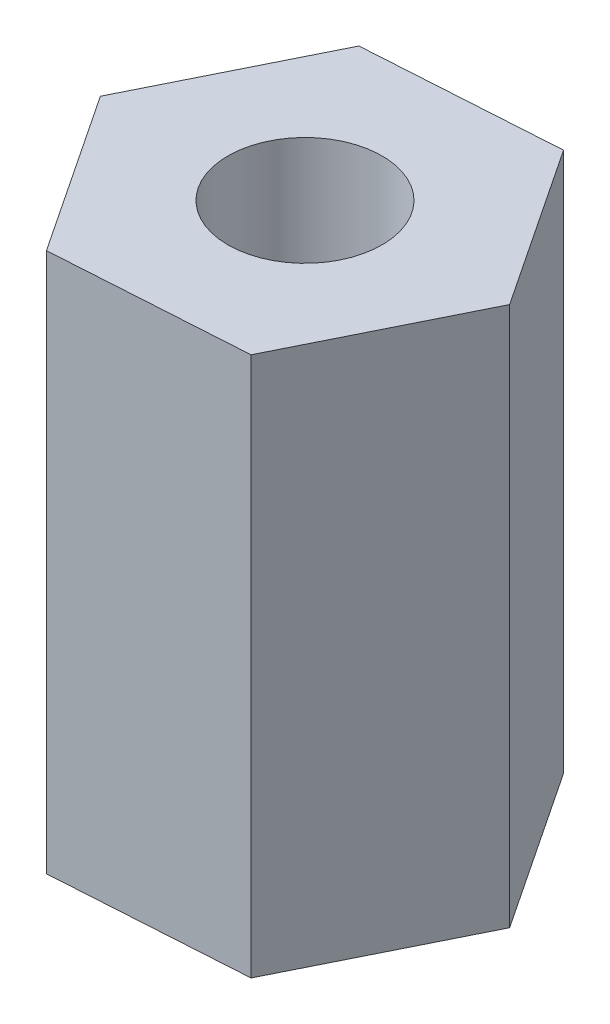
ISO-10303-21;
HEADER;
FILE_DESCRIPTION(('STEP AP214'),'2;1');
FILE_NAME('part.step','',(''),(''),'','','');
FILE_SCHEMA(('AUTOMOTIVE_DESIGN { 1 0 10303 214 1 1 1 1 }'));
ENDSEC;
DATA;
#1=APPLICATION_CONTEXT('core data for automotive mechanical design processes');
#2=APPLICATION_PROTOCOL_DEFINITION('international standard','automotive_design',2000,#1);
#3=PRODUCT_CONTEXT('',#1,'mechanical');
#4=PRODUCT('Part','Part','',(#3));
#5=PRODUCT_RELATED_PRODUCT_CATEGORY('part','',(#4));
#6=PRODUCT_DEFINITION_FORMATION('','',#4);
#7=PRODUCT_DEFINITION_CONTEXT('part definition',#1,'design');
#8=PRODUCT_DEFINITION('design','',#6,#7);
#9=PRODUCT_DEFINITION_SHAPE('','',#8);
#10=(LENGTH_UNIT() NAMED_UNIT(*) SI_UNIT(.MILLI.,.METRE.));
#11=(NAMED_UNIT(*) PLANE_ANGLE_UNIT() SI_UNIT($,.RADIAN.));
#12=(NAMED_UNIT(*) SI_UNIT($,.STERADIAN.) SOLID_ANGLE_UNIT());
#13=UNCERTAINTY_MEASURE_WITH_UNIT(LENGTH_MEASURE(1.E-05),#10,'distance_accuracy_value','');
#14=(GEOMETRIC_REPRESENTATION_CONTEXT(3) GLOBAL_UNCERTAINTY_ASSIGNED_CONTEXT((#13)) GLOBAL_UNIT_ASSIGNED_CONTEXT((#10,
#11,#12)) REPRESENTATION_CONTEXT('',''));
#15=CARTESIAN_POINT('',(0.,0.,0.));
#16=DIRECTION('',(0.,0.,1.));
#17=DIRECTION('',(1.,0.,0.));
#18=AXIS2_PLACEMENT_3D('',#15,#16,#17);
#19=CARTESIAN_POINT('',(-7.49074246217419,21.,0.471286217402918));
#20=DIRECTION('',(0.832920604348991,0.,-0.553392507042617));
#21=DIRECTION('',(-0.553392507042617,0.,-0.832920604348991));
#22=AXIS2_PLACEMENT_3D('',#19,#20,#21);
#23=PLANE('',#22);
#24=DIRECTION('',(0.553392507042617,0.,0.83292060434899));
#25=VECTOR('',#24,1.);
#26=CARTESIAN_POINT('',(-7.49074246217419,0.,0.471286217402918));
#27=LINE('',#26,#25);
#28=CARTESIAN_POINT('',(-7.49074246217419,0.,0.471286217402918));
#29=VERTEX_POINT('',#28);
#30=CARTESIAN_POINT('',(-3.33722539436269,0.,6.7228163741511));
#31=VERTEX_POINT('',#30);
#32=EDGE_CURVE('E144',#29,#31,#27,.T.);
#33=ORIENTED_EDGE('',*,*,#32,.T.);
#34=DIRECTION('',(0.,-1.,0.));
#35=VECTOR('',#34,1.);
#36=CARTESIAN_POINT('',(-3.33722539436269,21.,6.7228163741511));
#37=LINE('',#36,#35);
#38=CARTESIAN_POINT('',(-3.33722539436269,21.,6.7228163741511));
#39=VERTEX_POINT('',#38);
#40=EDGE_CURVE('E13',#39,#31,#37,.T.);
#41=ORIENTED_EDGE('',*,*,#40,.F.);
#42=DIRECTION('',(0.553392507042617,0.,0.83292060434899));
#43=VECTOR('',#42,1.);
#44=CARTESIAN_POINT('',(-7.49074246217419,21.,0.471286217402918));
#45=LINE('',#44,#43);
#46=CARTESIAN_POINT('',(-7.49074246217419,21.,0.471286217402918));
#47=VERTEX_POINT('',#46);
#48=EDGE_CURVE('E161',#47,#39,#45,.T.);
#49=ORIENTED_EDGE('',*,*,#48,.F.);
#50=DIRECTION('',(0.,-1.,0.));
#51=VECTOR('',#50,1.);
#52=CARTESIAN_POINT('',(-7.49074246217419,21.,0.471286217402918));
#53=LINE('',#52,#51);
#54=EDGE_CURVE('E140',#47,#29,#53,.T.);
#55=ORIENTED_EDGE('',*,*,#54,.T.);
#56=EDGE_LOOP('',(#33,#41,#49,#55));
#57=FACE_BOUND('',#56,.T.);
#58=ADVANCED_FACE('F52',(#57),#23,.F.);
#59=CARTESIAN_POINT('',(-3.33722539436269,21.,6.7228163741511));
#60=DIRECTION('',(-0.0627916671883695,0.,-0.998026656223021));
#61=DIRECTION('',(-0.998026656223022,0.,0.0627916671883695));
#62=AXIS2_PLACEMENT_3D('',#59,#60,#61);
#63=PLANE('',#62);
#64=DIRECTION('',(0.998026656223022,0.,-0.0627916671883695));
#65=VECTOR('',#64,1.);
#66=CARTESIAN_POINT('',(-3.33722539436269,0.,6.7228163741511));
#67=LINE('',#66,#65);
#68=CARTESIAN_POINT('',(4.15351706781149,0.,6.25153015674818));
#69=VERTEX_POINT('',#68);
#70=EDGE_CURVE('E148',#31,#69,#67,.T.);
#71=ORIENTED_EDGE('',*,*,#70,.T.);
#72=DIRECTION('',(0.,-1.,0.));
#73=VECTOR('',#72,1.);
#74=CARTESIAN_POINT('',(4.15351706781149,21.,6.25153015674818));
#75=LINE('',#74,#73);
#76=CARTESIAN_POINT('',(4.15351706781149,21.,6.25153015674818));
#77=VERTEX_POINT('',#76);
#78=EDGE_CURVE('E61',#77,#69,#75,.T.);
#79=ORIENTED_EDGE('',*,*,#78,.F.);
#80=DIRECTION('',(0.998026656223022,0.,-0.0627916671883695));
#81=VECTOR('',#80,1.);
#82=CARTESIAN_POINT('',(-3.33722539436269,21.,6.7228163741511));
#83=LINE('',#82,#81);
#84=EDGE_CURVE('E106',#39,#77,#83,.T.);
#85=ORIENTED_EDGE('',*,*,#84,.F.);
#86=ORIENTED_EDGE('',*,*,#40,.T.);
#87=EDGE_LOOP('',(#71,#79,#85,#86));
#88=FACE_BOUND('',#87,.T.);
#89=ADVANCED_FACE('F189',(#88),#63,.F.);
#90=CARTESIAN_POINT('',(4.15351706781149,21.,6.25153015674818));
#91=DIRECTION('',(-0.89571227153736,0.,-0.444634149180405));
#92=DIRECTION('',(-0.444634149180405,0.,0.89571227153736));
#93=AXIS2_PLACEMENT_3D('',#90,#91,#92);
#94=PLANE('',#93);
#95=DIRECTION('',(0.444634149180405,0.,-0.89571227153736));
#96=VECTOR('',#95,1.);
#97=CARTESIAN_POINT('',(4.15351706781149,0.,6.25153015674818));
#98=LINE('',#97,#96);
#99=CARTESIAN_POINT('',(7.49074246217418,0.,-0.471286217402919));
#100=VERTEX_POINT('',#99);
#101=EDGE_CURVE('E152',#69,#100,#98,.T.);
#102=ORIENTED_EDGE('',*,*,#101,.T.);
#103=DIRECTION('',(0.,-1.,0.));
#104=VECTOR('',#103,1.);
#105=CARTESIAN_POINT('',(7.49074246217418,21.,-0.471286217402919));
#106=LINE('',#105,#104);
#107=CARTESIAN_POINT('',(7.49074246217418,21.,-0.471286217402919));
#108=VERTEX_POINT('',#107);
#109=EDGE_CURVE('E130',#108,#100,#106,.T.);
#110=ORIENTED_EDGE('',*,*,#109,.F.);
#111=DIRECTION('',(0.444634149180405,0.,-0.89571227153736));
#112=VECTOR('',#111,1.);
#113=CARTESIAN_POINT('',(4.15351706781149,21.,6.25153015674818));
#114=LINE('',#113,#112);
#115=EDGE_CURVE('E119',#77,#108,#114,.T.);
#116=ORIENTED_EDGE('',*,*,#115,.F.);
#117=ORIENTED_EDGE('',*,*,#78,.T.);
#118=EDGE_LOOP('',(#102,#110,#116,#117));
#119=FACE_BOUND('',#118,.T.);
#120=ADVANCED_FACE('F170',(#119),#94,.F.);
#121=CARTESIAN_POINT('',(7.49074246217418,21.,-0.471286217402919));
#122=DIRECTION('',(-0.83292060434899,0.,0.553392507042617));
#123=DIRECTION('',(0.553392507042617,0.,0.832920604348991));
#124=AXIS2_PLACEMENT_3D('',#121,#122,#123);
#125=PLANE('',#124);
#126=DIRECTION('',(-0.553392507042617,0.,-0.832920604348991));
#127=VECTOR('',#126,1.);
#128=CARTESIAN_POINT('',(7.49074246217418,0.,-0.471286217402919));
#129=LINE('',#128,#127);
#130=CARTESIAN_POINT('',(3.33722539436269,0.,-6.7228163741511));
#131=VERTEX_POINT('',#130);
#132=EDGE_CURVE('E128',#100,#131,#129,.T.);
#133=ORIENTED_EDGE('',*,*,#132,.T.);
#134=DIRECTION('',(0.,-1.,0.));
#135=VECTOR('',#134,1.);
#136=CARTESIAN_POINT('',(3.33722539436269,21.,-6.7228163741511));
#137=LINE('',#136,#135);
#138=CARTESIAN_POINT('',(3.33722539436269,21.,-6.7228163741511));
#139=VERTEX_POINT('',#138);
#140=EDGE_CURVE('E125',#139,#131,#137,.T.);
#141=ORIENTED_EDGE('',*,*,#140,.F.);
#142=DIRECTION('',(-0.553392507042617,0.,-0.832920604348991));
#143=VECTOR('',#142,1.);
#144=CARTESIAN_POINT('',(7.49074246217418,21.,-0.471286217402919));
#145=LINE('',#144,#143);
#146=EDGE_CURVE('E113',#108,#139,#145,.T.);
#147=ORIENTED_EDGE('',*,*,#146,.F.);
#148=ORIENTED_EDGE('',*,*,#109,.T.);
#149=EDGE_LOOP('',(#133,#141,#147,#148));
#150=FACE_BOUND('',#149,.T.);
#151=ADVANCED_FACE('F126',(#150),#125,.F.);
#152=CARTESIAN_POINT('',(3.33722539436269,21.,-6.7228163741511));
#153=DIRECTION('',(0.0627916671883696,0.,0.998026656223021));
#154=DIRECTION('',(0.998026656223022,0.,-0.0627916671883696));
#155=AXIS2_PLACEMENT_3D('',#152,#153,#154);
#156=PLANE('',#155);
#157=DIRECTION('',(-0.998026656223022,0.,0.0627916671883696));
#158=VECTOR('',#157,1.);
#159=CARTESIAN_POINT('',(3.33722539436269,0.,-6.7228163741511));
#160=LINE('',#159,#158);
#161=CARTESIAN_POINT('',(-4.1535170678115,0.,-6.25153015674818));
#162=VERTEX_POINT('',#161);
#163=EDGE_CURVE('E92',#131,#162,#160,.T.);
#164=ORIENTED_EDGE('',*,*,#163,.T.);
#165=DIRECTION('',(0.,-1.,0.));
#166=VECTOR('',#165,1.);
#167=CARTESIAN_POINT('',(-4.1535170678115,21.,-6.25153015674818));
#168=LINE('',#167,#166);
#169=CARTESIAN_POINT('',(-4.1535170678115,21.,-6.25153015674818));
#170=VERTEX_POINT('',#169);
#171=EDGE_CURVE('E131',#170,#162,#168,.T.);
#172=ORIENTED_EDGE('',*,*,#171,.F.);
#173=DIRECTION('',(-0.998026656223022,0.,0.0627916671883696));
#174=VECTOR('',#173,1.);
#175=CARTESIAN_POINT('',(3.33722539436269,21.,-6.7228163741511));
#176=LINE('',#175,#174);
#177=EDGE_CURVE('E117',#139,#170,#176,.T.);
#178=ORIENTED_EDGE('',*,*,#177,.F.);
#179=ORIENTED_EDGE('',*,*,#140,.T.);
#180=EDGE_LOOP('',(#164,#172,#178,#179));
#181=FACE_BOUND('',#180,.T.);
#182=ADVANCED_FACE('F133',(#181),#156,.F.);
#183=CARTESIAN_POINT('',(-4.1535170678115,21.,-6.25153015674818));
#184=DIRECTION('',(0.89571227153736,0.,0.444634149180405));
#185=DIRECTION('',(0.444634149180405,0.,-0.89571227153736));
#186=AXIS2_PLACEMENT_3D('',#183,#184,#185);
#187=PLANE('',#186);
#188=DIRECTION('',(-0.444634149180405,0.,0.89571227153736));
#189=VECTOR('',#188,1.);
#190=CARTESIAN_POINT('',(-4.1535170678115,0.,-6.25153015674818));
#191=LINE('',#190,#189);
#192=EDGE_CURVE('E98',#162,#29,#191,.T.);
#193=ORIENTED_EDGE('',*,*,#192,.T.);
#194=ORIENTED_EDGE('',*,*,#54,.F.);
#195=DIRECTION('',(-0.444634149180405,0.,0.89571227153736));
#196=VECTOR('',#195,1.);
#197=CARTESIAN_POINT('',(-4.1535170678115,21.,-6.25153015674818));
#198=LINE('',#197,#196);
#199=EDGE_CURVE('E69',#170,#47,#198,.T.);
#200=ORIENTED_EDGE('',*,*,#199,.F.);
#201=ORIENTED_EDGE('',*,*,#171,.T.);
#202=EDGE_LOOP('',(#193,#194,#200,#201));
#203=FACE_BOUND('',#202,.T.);
#204=ADVANCED_FACE('F177',(#203),#187,.F.);
#205=CARTESIAN_POINT('',(0.,21.,0.));
#206=DIRECTION('',(0.,1.,0.));
#207=DIRECTION('',(0.,0.,1.));
#208=AXIS2_PLACEMENT_3D('',#205,#206,#207);
#209=PLANE('',#208);
#210=CARTESIAN_POINT('',(0.,21.,0.));
#211=DIRECTION('',(0.,1.,0.));
#212=DIRECTION('',(0.,0.,1.));
#213=AXIS2_PLACEMENT_3D('',#210,#211,#212);
#214=CIRCLE('',#213,3.);
#215=CARTESIAN_POINT('',(0.,21.,3.));
#216=VERTEX_POINT('',#215);
#217=EDGE_CURVE('E238',#216,#216,#214,.T.);
#218=ORIENTED_EDGE('',*,*,#217,.F.);
#219=EDGE_LOOP('',(#218));
#220=FACE_BOUND('',#219,.T.);
#221=ORIENTED_EDGE('',*,*,#48,.T.);
#222=ORIENTED_EDGE('',*,*,#84,.T.);
#223=ORIENTED_EDGE('',*,*,#115,.T.);
#224=ORIENTED_EDGE('',*,*,#146,.T.);
#225=ORIENTED_EDGE('',*,*,#177,.T.);
#226=ORIENTED_EDGE('',*,*,#199,.T.);
#227=EDGE_LOOP('',(#221,#222,#223,#224,#225,#226));
#228=FACE_BOUND('',#227,.T.);
#229=ADVANCED_FACE('F115',(#220,#228),#209,.T.);
#230=CARTESIAN_POINT('',(0.,0.,0.));
#231=DIRECTION('',(0.,1.,0.));
#232=DIRECTION('',(0.,0.,1.));
#233=AXIS2_PLACEMENT_3D('',#230,#231,#232);
#234=PLANE('',#233);
#235=CARTESIAN_POINT('',(0.,0.,0.));
#236=DIRECTION('',(0.,1.,0.));
#237=DIRECTION('',(0.,0.,1.));
#238=AXIS2_PLACEMENT_3D('',#235,#236,#237);
#239=CIRCLE('',#238,3.);
#240=CARTESIAN_POINT('',(0.,0.,3.));
#241=VERTEX_POINT('',#240);
#242=EDGE_CURVE('E149',#241,#241,#239,.T.);
#243=ORIENTED_EDGE('',*,*,#242,.T.);
#244=EDGE_LOOP('',(#243));
#245=FACE_BOUND('',#244,.T.);
#246=ORIENTED_EDGE('',*,*,#32,.F.);
#247=ORIENTED_EDGE('',*,*,#192,.F.);
#248=ORIENTED_EDGE('',*,*,#163,.F.);
#249=ORIENTED_EDGE('',*,*,#132,.F.);
#250=ORIENTED_EDGE('',*,*,#101,.F.);
#251=ORIENTED_EDGE('',*,*,#70,.F.);
#252=EDGE_LOOP('',(#246,#247,#248,#249,#250,#251));
#253=FACE_BOUND('',#252,.T.);
#254=ADVANCED_FACE('F173',(#245,#253),#234,.F.);
#255=CARTESIAN_POINT('',(0.,0.,0.));
#256=DIRECTION('',(0.,1.,0.));
#257=DIRECTION('',(0.,0.,1.));
#258=AXIS2_PLACEMENT_3D('',#255,#256,#257);
#259=CYLINDRICAL_SURFACE('',#258,3.);
#260=ORIENTED_EDGE('',*,*,#242,.F.);
#261=EDGE_LOOP('',(#260));
#262=FACE_BOUND('',#261,.T.);
#263=ORIENTED_EDGE('',*,*,#217,.T.);
#264=EDGE_LOOP('',(#263));
#265=FACE_BOUND('',#264,.T.);
#266=ADVANCED_FACE('F222',(#262,#265),#259,.F.);
#267=CLOSED_SHELL('',(#58,#89,#120,#151,#182,#204,#229,#254,#266));
#268=MANIFOLD_SOLID_BREP('B2',#267);
#269=ADVANCED_BREP_SHAPE_REPRESENTATION('',(#18,#268),#14);
#270=SHAPE_DEFINITION_REPRESENTATION(#9,#269);
ENDSEC;
END-ISO-10303-21;
